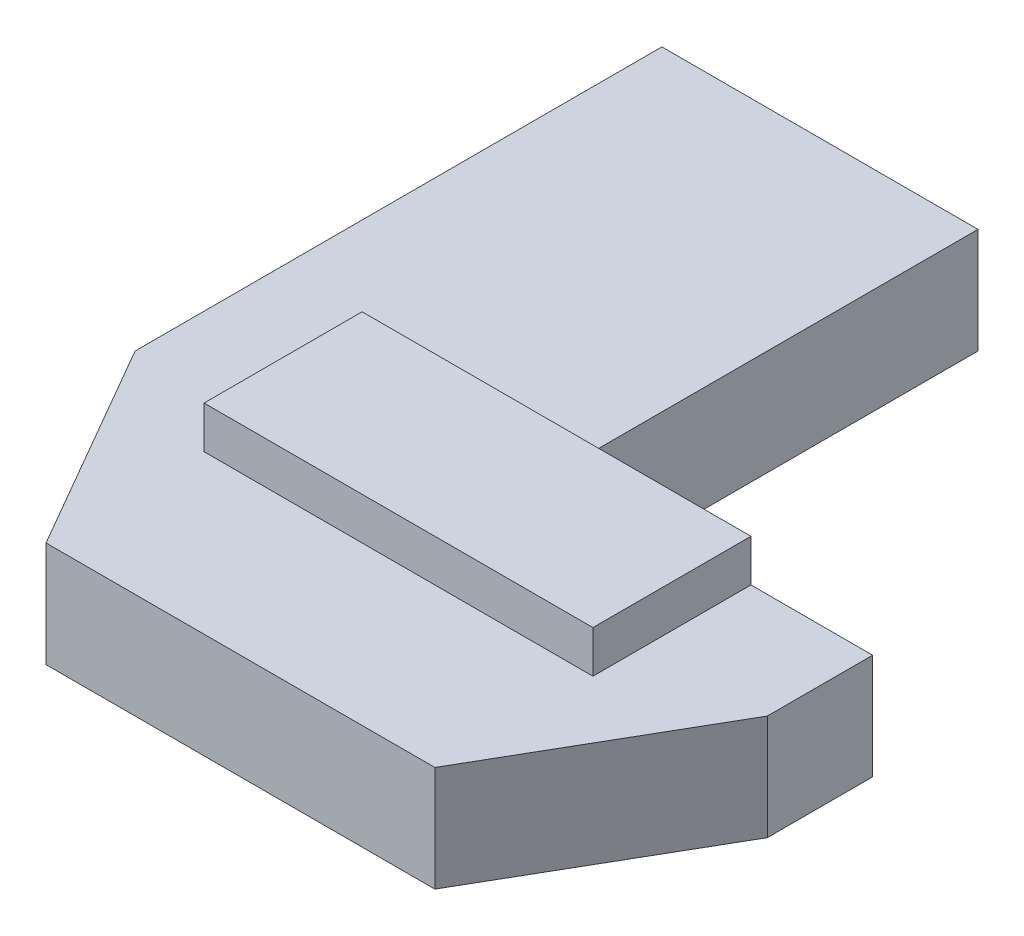
ISO-10303-21;
HEADER;
FILE_DESCRIPTION(('STEP AP214'),'2;1');
FILE_NAME('part.step','',(''),(''),'','','');
FILE_SCHEMA(('AUTOMOTIVE_DESIGN { 1 0 10303 214 1 1 1 1 }'));
ENDSEC;
DATA;
#1=APPLICATION_CONTEXT('core data for automotive mechanical design processes');
#2=APPLICATION_PROTOCOL_DEFINITION('international standard','automotive_design',2000,#1);
#3=PRODUCT_CONTEXT('',#1,'mechanical');
#4=PRODUCT('Part','Part','',(#3));
#5=PRODUCT_RELATED_PRODUCT_CATEGORY('part','',(#4));
#6=PRODUCT_DEFINITION_FORMATION('','',#4);
#7=PRODUCT_DEFINITION_CONTEXT('part definition',#1,'design');
#8=PRODUCT_DEFINITION('design','',#6,#7);
#9=PRODUCT_DEFINITION_SHAPE('','',#8);
#10=(LENGTH_UNIT() NAMED_UNIT(*) SI_UNIT(.MILLI.,.METRE.));
#11=(NAMED_UNIT(*) PLANE_ANGLE_UNIT() SI_UNIT($,.RADIAN.));
#12=(NAMED_UNIT(*) SI_UNIT($,.STERADIAN.) SOLID_ANGLE_UNIT());
#13=UNCERTAINTY_MEASURE_WITH_UNIT(LENGTH_MEASURE(1.E-05),#10,'distance_accuracy_value','');
#14=(GEOMETRIC_REPRESENTATION_CONTEXT(3) GLOBAL_UNCERTAINTY_ASSIGNED_CONTEXT((#13)) GLOBAL_UNIT_ASSIGNED_CONTEXT((#10,
#11,#12)) REPRESENTATION_CONTEXT('',''));
#15=CARTESIAN_POINT('',(0.,0.,0.));
#16=DIRECTION('',(0.,0.,1.));
#17=DIRECTION('',(1.,0.,0.));
#18=AXIS2_PLACEMENT_3D('',#15,#16,#17);
#19=CARTESIAN_POINT('',(0.,5.,0.));
#20=DIRECTION('',(0.,-1.,0.));
#21=DIRECTION('',(0.,0.,-1.));
#22=AXIS2_PLACEMENT_3D('',#19,#20,#21);
#23=PLANE('',#22);
#24=DIRECTION('',(0.,0.,-1.));
#25=VECTOR('',#24,1.);
#26=CARTESIAN_POINT('',(9.22649730810377,5.,0.));
#27=LINE('',#26,#25);
#28=CARTESIAN_POINT('',(9.22649730810378,5.,7.5));
#29=VERTEX_POINT('',#28);
#30=CARTESIAN_POINT('',(9.22649730810377,5.,0.));
#31=VERTEX_POINT('',#30);
#32=EDGE_CURVE('E37',#29,#31,#27,.T.);
#33=ORIENTED_EDGE('',*,*,#32,.F.);
#34=DIRECTION('',(1.,0.,0.));
#35=VECTOR('',#34,1.);
#36=CARTESIAN_POINT('',(9.22649730810378,5.,7.5));
#37=LINE('',#36,#35);
#38=CARTESIAN_POINT('',(-9.22649730810377,5.,7.5));
#39=VERTEX_POINT('',#38);
#40=EDGE_CURVE('E54',#39,#29,#37,.T.);
#41=ORIENTED_EDGE('',*,*,#40,.F.);
#42=DIRECTION('',(0.,0.,1.));
#43=VECTOR('',#42,1.);
#44=CARTESIAN_POINT('',(-9.22649730810377,5.,0.));
#45=LINE('',#44,#43);
#46=CARTESIAN_POINT('',(-9.22649730810377,5.,0.));
#47=VERTEX_POINT('',#46);
#48=EDGE_CURVE('E245',#47,#39,#45,.T.);
#49=ORIENTED_EDGE('',*,*,#48,.F.);
#50=DIRECTION('',(-1.,0.,0.));
#51=VECTOR('',#50,1.);
#52=CARTESIAN_POINT('',(9.22649730810377,5.,0.));
#53=LINE('',#52,#51);
#54=CARTESIAN_POINT('',(0.,5.,0.));
#55=VERTEX_POINT('',#54);
#56=EDGE_CURVE('E11',#55,#47,#53,.T.);
#57=ORIENTED_EDGE('',*,*,#56,.F.);
#58=DIRECTION('',(0.,0.,-1.));
#59=VECTOR('',#58,1.);
#60=CARTESIAN_POINT('',(0.,5.,0.));
#61=LINE('',#60,#59);
#62=CARTESIAN_POINT('',(0.,5.,-20.));
#63=VERTEX_POINT('',#62);
#64=EDGE_CURVE('E159',#55,#63,#61,.T.);
#65=ORIENTED_EDGE('',*,*,#64,.T.);
#66=DIRECTION('',(-1.,0.,0.));
#67=VECTOR('',#66,1.);
#68=CARTESIAN_POINT('',(0.,5.,-20.));
#69=LINE('',#68,#67);
#70=CARTESIAN_POINT('',(-15.,5.,-20.));
#71=VERTEX_POINT('',#70);
#72=EDGE_CURVE('E160',#63,#71,#69,.T.);
#73=ORIENTED_EDGE('',*,*,#72,.T.);
#74=DIRECTION('',(0.,0.,-1.));
#75=VECTOR('',#74,1.);
#76=CARTESIAN_POINT('',(-15.,5.,-20.));
#77=LINE('',#76,#75);
#78=CARTESIAN_POINT('',(-15.,5.,5.));
#79=VERTEX_POINT('',#78);
#80=EDGE_CURVE('E216',#79,#71,#77,.T.);
#81=ORIENTED_EDGE('',*,*,#80,.F.);
#82=DIRECTION('',(-0.499999999999998,0.,-0.86602540378444));
#83=VECTOR('',#82,1.);
#84=CARTESIAN_POINT('',(-15.,5.,5.));
#85=LINE('',#84,#83);
#86=CARTESIAN_POINT('',(-9.22649730810377,5.,15.));
#87=VERTEX_POINT('',#86);
#88=EDGE_CURVE('E213',#87,#79,#85,.T.);
#89=ORIENTED_EDGE('',*,*,#88,.F.);
#90=DIRECTION('',(-1.,0.,0.));
#91=VECTOR('',#90,1.);
#92=CARTESIAN_POINT('',(-9.22649730810377,5.,15.));
#93=LINE('',#92,#91);
#94=CARTESIAN_POINT('',(9.22649730810378,5.,15.));
#95=VERTEX_POINT('',#94);
#96=EDGE_CURVE('E210',#95,#87,#93,.T.);
#97=ORIENTED_EDGE('',*,*,#96,.F.);
#98=DIRECTION('',(-0.499999999999998,0.,0.86602540378444));
#99=VECTOR('',#98,1.);
#100=CARTESIAN_POINT('',(9.22649730810378,5.,15.));
#101=LINE('',#100,#99);
#102=CARTESIAN_POINT('',(15.,5.,5.));
#103=VERTEX_POINT('',#102);
#104=EDGE_CURVE('E202',#103,#95,#101,.T.);
#105=ORIENTED_EDGE('',*,*,#104,.F.);
#106=DIRECTION('',(0.,0.,1.));
#107=VECTOR('',#106,1.);
#108=CARTESIAN_POINT('',(15.,5.,5.));
#109=LINE('',#108,#107);
#110=CARTESIAN_POINT('',(15.,5.,0.));
#111=VERTEX_POINT('',#110);
#112=EDGE_CURVE('E199',#111,#103,#109,.T.);
#113=ORIENTED_EDGE('',*,*,#112,.F.);
#114=DIRECTION('',(-1.,0.,0.));
#115=VECTOR('',#114,1.);
#116=CARTESIAN_POINT('',(25.,5.,0.));
#117=LINE('',#116,#115);
#118=EDGE_CURVE('E161',#111,#31,#117,.T.);
#119=ORIENTED_EDGE('',*,*,#118,.T.);
#120=EDGE_LOOP('',(#33,#41,#49,#57,#65,#73,#81,#89,#97,#105,#113,#119));
#121=FACE_BOUND('',#120,.T.);
#122=ADVANCED_FACE('F33',(#121),#23,.F.);
#123=CARTESIAN_POINT('',(25.,5.,0.));
#124=DIRECTION('',(0.,0.,1.));
#125=DIRECTION('',(1.,0.,0.));
#126=AXIS2_PLACEMENT_3D('',#123,#124,#125);
#127=PLANE('',#126);
#128=ORIENTED_EDGE('',*,*,#118,.F.);
#129=DIRECTION('',(0.,1.,0.));
#130=VECTOR('',#129,1.);
#131=CARTESIAN_POINT('',(15.,-0.00100000000000013,0.));
#132=LINE('',#131,#130);
#133=CARTESIAN_POINT('',(15.,0.,0.));
#134=VERTEX_POINT('',#133);
#135=EDGE_CURVE('E172',#134,#111,#132,.T.);
#136=ORIENTED_EDGE('',*,*,#135,.F.);
#137=DIRECTION('',(-1.,0.,0.));
#138=VECTOR('',#137,1.);
#139=CARTESIAN_POINT('',(25.,0.,0.));
#140=LINE('',#139,#138);
#141=CARTESIAN_POINT('',(0.,0.,0.));
#142=VERTEX_POINT('',#141);
#143=EDGE_CURVE('E176',#134,#142,#140,.T.);
#144=ORIENTED_EDGE('',*,*,#143,.T.);
#145=DIRECTION('',(0.,-1.,0.));
#146=VECTOR('',#145,1.);
#147=CARTESIAN_POINT('',(0.,5.,0.));
#148=LINE('',#147,#146);
#149=EDGE_CURVE('E43',#55,#142,#148,.T.);
#150=ORIENTED_EDGE('',*,*,#149,.F.);
#151=ORIENTED_EDGE('',*,*,#56,.T.);
#152=DIRECTION('',(0.,-1.,0.));
#153=VECTOR('',#152,1.);
#154=CARTESIAN_POINT('',(-9.22649730810377,7.,0.));
#155=LINE('',#154,#153);
#156=CARTESIAN_POINT('',(-9.22649730810377,7.,0.));
#157=VERTEX_POINT('',#156);
#158=EDGE_CURVE('E128',#157,#47,#155,.T.);
#159=ORIENTED_EDGE('',*,*,#158,.F.);
#160=DIRECTION('',(-1.,0.,0.));
#161=VECTOR('',#160,1.);
#162=CARTESIAN_POINT('',(9.22649730810377,7.,0.));
#163=LINE('',#162,#161);
#164=CARTESIAN_POINT('',(9.22649730810377,7.,0.));
#165=VERTEX_POINT('',#164);
#166=EDGE_CURVE('E122',#165,#157,#163,.T.);
#167=ORIENTED_EDGE('',*,*,#166,.F.);
#168=DIRECTION('',(0.,-1.,0.));
#169=VECTOR('',#168,1.);
#170=CARTESIAN_POINT('',(9.22649730810377,7.,0.));
#171=LINE('',#170,#169);
#172=EDGE_CURVE('E126',#165,#31,#171,.T.);
#173=ORIENTED_EDGE('',*,*,#172,.T.);
#174=EDGE_LOOP('',(#128,#136,#144,#150,#151,#159,#167,#173));
#175=FACE_BOUND('',#174,.T.);
#176=ADVANCED_FACE('F35',(#175),#127,.F.);
#177=CARTESIAN_POINT('',(0.,5.,0.));
#178=DIRECTION('',(-1.,0.,0.));
#179=DIRECTION('',(0.,0.,1.));
#180=AXIS2_PLACEMENT_3D('',#177,#178,#179);
#181=PLANE('',#180);
#182=DIRECTION('',(0.,0.,-1.));
#183=VECTOR('',#182,1.);
#184=CARTESIAN_POINT('',(0.,0.,0.));
#185=LINE('',#184,#183);
#186=CARTESIAN_POINT('',(0.,0.,-20.));
#187=VERTEX_POINT('',#186);
#188=EDGE_CURVE('E178',#142,#187,#185,.T.);
#189=ORIENTED_EDGE('',*,*,#188,.T.);
#190=DIRECTION('',(0.,-1.,0.));
#191=VECTOR('',#190,1.);
#192=CARTESIAN_POINT('',(0.,5.,-20.));
#193=LINE('',#192,#191);
#194=EDGE_CURVE('E156',#63,#187,#193,.T.);
#195=ORIENTED_EDGE('',*,*,#194,.F.);
#196=ORIENTED_EDGE('',*,*,#64,.F.);
#197=ORIENTED_EDGE('',*,*,#149,.T.);
#198=EDGE_LOOP('',(#189,#195,#196,#197));
#199=FACE_BOUND('',#198,.T.);
#200=ADVANCED_FACE('F269',(#199),#181,.F.);
#201=CARTESIAN_POINT('',(0.,5.,-20.));
#202=DIRECTION('',(0.,0.,1.));
#203=DIRECTION('',(1.,0.,0.));
#204=AXIS2_PLACEMENT_3D('',#201,#202,#203);
#205=PLANE('',#204);
#206=DIRECTION('',(-1.,0.,0.));
#207=VECTOR('',#206,1.);
#208=CARTESIAN_POINT('',(0.,0.,-20.));
#209=LINE('',#208,#207);
#210=CARTESIAN_POINT('',(-15.,0.,-20.));
#211=VERTEX_POINT('',#210);
#212=EDGE_CURVE('E167',#187,#211,#209,.T.);
#213=ORIENTED_EDGE('',*,*,#212,.T.);
#214=DIRECTION('',(0.,1.,0.));
#215=VECTOR('',#214,1.);
#216=CARTESIAN_POINT('',(-15.,-0.00100000000000013,-20.));
#217=LINE('',#216,#215);
#218=EDGE_CURVE('E179',#211,#71,#217,.T.);
#219=ORIENTED_EDGE('',*,*,#218,.T.);
#220=ORIENTED_EDGE('',*,*,#72,.F.);
#221=ORIENTED_EDGE('',*,*,#194,.T.);
#222=EDGE_LOOP('',(#213,#219,#220,#221));
#223=FACE_BOUND('',#222,.T.);
#224=ADVANCED_FACE('F185',(#223),#205,.F.);
#225=CARTESIAN_POINT('',(0.,0.,0.));
#226=DIRECTION('',(0.,-1.,0.));
#227=DIRECTION('',(0.,0.,-1.));
#228=AXIS2_PLACEMENT_3D('',#225,#226,#227);
#229=PLANE('',#228);
#230=DIRECTION('',(0.,0.,-1.));
#231=VECTOR('',#230,1.);
#232=CARTESIAN_POINT('',(-15.,0.,-20.));
#233=LINE('',#232,#231);
#234=CARTESIAN_POINT('',(-15.,0.,5.));
#235=VERTEX_POINT('',#234);
#236=EDGE_CURVE('E194',#235,#211,#233,.T.);
#237=ORIENTED_EDGE('',*,*,#236,.T.);
#238=ORIENTED_EDGE('',*,*,#212,.F.);
#239=ORIENTED_EDGE('',*,*,#188,.F.);
#240=ORIENTED_EDGE('',*,*,#143,.F.);
#241=DIRECTION('',(0.,0.,1.));
#242=VECTOR('',#241,1.);
#243=CARTESIAN_POINT('',(15.,0.,5.));
#244=LINE('',#243,#242);
#245=CARTESIAN_POINT('',(15.,0.,5.));
#246=VERTEX_POINT('',#245);
#247=EDGE_CURVE('E143',#134,#246,#244,.T.);
#248=ORIENTED_EDGE('',*,*,#247,.T.);
#249=DIRECTION('',(-0.499999999999998,0.,0.86602540378444));
#250=VECTOR('',#249,1.);
#251=CARTESIAN_POINT('',(9.22649730810378,0.,15.));
#252=LINE('',#251,#250);
#253=CARTESIAN_POINT('',(9.22649730810378,0.,15.));
#254=VERTEX_POINT('',#253);
#255=EDGE_CURVE('E146',#246,#254,#252,.T.);
#256=ORIENTED_EDGE('',*,*,#255,.T.);
#257=DIRECTION('',(-1.,0.,0.));
#258=VECTOR('',#257,1.);
#259=CARTESIAN_POINT('',(-9.22649730810377,0.,15.));
#260=LINE('',#259,#258);
#261=CARTESIAN_POINT('',(-9.22649730810377,0.,15.));
#262=VERTEX_POINT('',#261);
#263=EDGE_CURVE('E204',#254,#262,#260,.T.);
#264=ORIENTED_EDGE('',*,*,#263,.T.);
#265=DIRECTION('',(-0.499999999999998,0.,-0.86602540378444));
#266=VECTOR('',#265,1.);
#267=CARTESIAN_POINT('',(-15.,0.,5.));
#268=LINE('',#267,#266);
#269=EDGE_CURVE('E196',#262,#235,#268,.T.);
#270=ORIENTED_EDGE('',*,*,#269,.T.);
#271=EDGE_LOOP('',(#237,#238,#239,#240,#248,#256,#264,#270));
#272=FACE_BOUND('',#271,.T.);
#273=ADVANCED_FACE('F191',(#272),#229,.T.);
#274=CARTESIAN_POINT('',(-15.,-0.00100000000000013,-20.));
#275=DIRECTION('',(1.,0.,0.));
#276=DIRECTION('',(0.,0.,-1.));
#277=AXIS2_PLACEMENT_3D('',#274,#275,#276);
#278=PLANE('',#277);
#279=DIRECTION('',(0.,1.,0.));
#280=VECTOR('',#279,1.);
#281=CARTESIAN_POINT('',(-15.,-0.00100000000000013,5.));
#282=LINE('',#281,#280);
#283=EDGE_CURVE('E219',#235,#79,#282,.T.);
#284=ORIENTED_EDGE('',*,*,#283,.T.);
#285=ORIENTED_EDGE('',*,*,#80,.T.);
#286=ORIENTED_EDGE('',*,*,#218,.F.);
#287=ORIENTED_EDGE('',*,*,#236,.F.);
#288=EDGE_LOOP('',(#284,#285,#286,#287));
#289=FACE_BOUND('',#288,.T.);
#290=ADVANCED_FACE('F275',(#289),#278,.F.);
#291=CARTESIAN_POINT('',(-15.,-0.00100000000000013,5.));
#292=DIRECTION('',(0.86602540378444,0.,-0.499999999999998));
#293=DIRECTION('',(-0.499999999999998,0.,-0.86602540378444));
#294=AXIS2_PLACEMENT_3D('',#291,#292,#293);
#295=PLANE('',#294);
#296=DIRECTION('',(0.,1.,0.));
#297=VECTOR('',#296,1.);
#298=CARTESIAN_POINT('',(-9.22649730810377,-0.00100000000000013,15.));
#299=LINE('',#298,#297);
#300=EDGE_CURVE('E221',#262,#87,#299,.T.);
#301=ORIENTED_EDGE('',*,*,#300,.T.);
#302=ORIENTED_EDGE('',*,*,#88,.T.);
#303=ORIENTED_EDGE('',*,*,#283,.F.);
#304=ORIENTED_EDGE('',*,*,#269,.F.);
#305=EDGE_LOOP('',(#301,#302,#303,#304));
#306=FACE_BOUND('',#305,.T.);
#307=ADVANCED_FACE('F286',(#306),#295,.F.);
#308=CARTESIAN_POINT('',(-9.22649730810377,-0.00100000000000013,15.));
#309=DIRECTION('',(0.,0.,-1.));
#310=DIRECTION('',(-1.,0.,0.));
#311=AXIS2_PLACEMENT_3D('',#308,#309,#310);
#312=PLANE('',#311);
#313=DIRECTION('',(0.,1.,0.));
#314=VECTOR('',#313,1.);
#315=CARTESIAN_POINT('',(9.22649730810378,-0.00100000000000013,15.));
#316=LINE('',#315,#314);
#317=EDGE_CURVE('E223',#254,#95,#316,.T.);
#318=ORIENTED_EDGE('',*,*,#317,.T.);
#319=ORIENTED_EDGE('',*,*,#96,.T.);
#320=ORIENTED_EDGE('',*,*,#300,.F.);
#321=ORIENTED_EDGE('',*,*,#263,.F.);
#322=EDGE_LOOP('',(#318,#319,#320,#321));
#323=FACE_BOUND('',#322,.T.);
#324=ADVANCED_FACE('F288',(#323),#312,.F.);
#325=CARTESIAN_POINT('',(9.22649730810378,-0.00100000000000013,15.));
#326=DIRECTION('',(-0.86602540378444,0.,-0.499999999999998));
#327=DIRECTION('',(-0.499999999999998,0.,0.86602540378444));
#328=AXIS2_PLACEMENT_3D('',#325,#326,#327);
#329=PLANE('',#328);
#330=DIRECTION('',(0.,1.,0.));
#331=VECTOR('',#330,1.);
#332=CARTESIAN_POINT('',(15.,-0.00100000000000013,5.));
#333=LINE('',#332,#331);
#334=EDGE_CURVE('E224',#246,#103,#333,.T.);
#335=ORIENTED_EDGE('',*,*,#334,.T.);
#336=ORIENTED_EDGE('',*,*,#104,.T.);
#337=ORIENTED_EDGE('',*,*,#317,.F.);
#338=ORIENTED_EDGE('',*,*,#255,.F.);
#339=EDGE_LOOP('',(#335,#336,#337,#338));
#340=FACE_BOUND('',#339,.T.);
#341=ADVANCED_FACE('F235',(#340),#329,.F.);
#342=CARTESIAN_POINT('',(15.,-0.00100000000000013,5.));
#343=DIRECTION('',(-1.,0.,0.));
#344=DIRECTION('',(0.,0.,1.));
#345=AXIS2_PLACEMENT_3D('',#342,#343,#344);
#346=PLANE('',#345);
#347=ORIENTED_EDGE('',*,*,#135,.T.);
#348=ORIENTED_EDGE('',*,*,#112,.T.);
#349=ORIENTED_EDGE('',*,*,#334,.F.);
#350=ORIENTED_EDGE('',*,*,#247,.F.);
#351=EDGE_LOOP('',(#347,#348,#349,#350));
#352=FACE_BOUND('',#351,.T.);
#353=ADVANCED_FACE('F230',(#352),#346,.F.);
#354=CARTESIAN_POINT('',(9.22649730810377,7.,0.));
#355=DIRECTION('',(-1.,0.,0.));
#356=DIRECTION('',(0.,0.,1.));
#357=AXIS2_PLACEMENT_3D('',#354,#355,#356);
#358=PLANE('',#357);
#359=ORIENTED_EDGE('',*,*,#32,.T.);
#360=ORIENTED_EDGE('',*,*,#172,.F.);
#361=DIRECTION('',(0.,0.,-1.));
#362=VECTOR('',#361,1.);
#363=CARTESIAN_POINT('',(9.22649730810377,7.,0.));
#364=LINE('',#363,#362);
#365=CARTESIAN_POINT('',(9.22649730810378,7.,7.5));
#366=VERTEX_POINT('',#365);
#367=EDGE_CURVE('E132',#366,#165,#364,.T.);
#368=ORIENTED_EDGE('',*,*,#367,.F.);
#369=DIRECTION('',(0.,-1.,0.));
#370=VECTOR('',#369,1.);
#371=CARTESIAN_POINT('',(9.22649730810378,7.,7.5));
#372=LINE('',#371,#370);
#373=EDGE_CURVE('E242',#366,#29,#372,.T.);
#374=ORIENTED_EDGE('',*,*,#373,.T.);
#375=EDGE_LOOP('',(#359,#360,#368,#374));
#376=FACE_BOUND('',#375,.T.);
#377=ADVANCED_FACE('F142',(#376),#358,.F.);
#378=CARTESIAN_POINT('',(-9.22649730810377,7.,0.));
#379=DIRECTION('',(1.,0.,0.));
#380=DIRECTION('',(0.,0.,-1.));
#381=AXIS2_PLACEMENT_3D('',#378,#379,#380);
#382=PLANE('',#381);
#383=ORIENTED_EDGE('',*,*,#48,.T.);
#384=DIRECTION('',(0.,-1.,0.));
#385=VECTOR('',#384,1.);
#386=CARTESIAN_POINT('',(-9.22649730810377,7.,7.5));
#387=LINE('',#386,#385);
#388=CARTESIAN_POINT('',(-9.22649730810377,7.,7.5));
#389=VERTEX_POINT('',#388);
#390=EDGE_CURVE('E148',#389,#39,#387,.T.);
#391=ORIENTED_EDGE('',*,*,#390,.F.);
#392=DIRECTION('',(0.,0.,1.));
#393=VECTOR('',#392,1.);
#394=CARTESIAN_POINT('',(-9.22649730810377,7.,0.));
#395=LINE('',#394,#393);
#396=EDGE_CURVE('E131',#157,#389,#395,.T.);
#397=ORIENTED_EDGE('',*,*,#396,.F.);
#398=ORIENTED_EDGE('',*,*,#158,.T.);
#399=EDGE_LOOP('',(#383,#391,#397,#398));
#400=FACE_BOUND('',#399,.T.);
#401=ADVANCED_FACE('F251',(#400),#382,.F.);
#402=CARTESIAN_POINT('',(9.22649730810378,7.,7.5));
#403=DIRECTION('',(0.,0.,-1.));
#404=DIRECTION('',(-1.,0.,0.));
#405=AXIS2_PLACEMENT_3D('',#402,#403,#404);
#406=PLANE('',#405);
#407=ORIENTED_EDGE('',*,*,#40,.T.);
#408=ORIENTED_EDGE('',*,*,#373,.F.);
#409=DIRECTION('',(1.,0.,0.));
#410=VECTOR('',#409,1.);
#411=CARTESIAN_POINT('',(9.22649730810378,7.,7.5));
#412=LINE('',#411,#410);
#413=EDGE_CURVE('E137',#389,#366,#412,.T.);
#414=ORIENTED_EDGE('',*,*,#413,.F.);
#415=ORIENTED_EDGE('',*,*,#390,.T.);
#416=EDGE_LOOP('',(#407,#408,#414,#415));
#417=FACE_BOUND('',#416,.T.);
#418=ADVANCED_FACE('F253',(#417),#406,.F.);
#419=CARTESIAN_POINT('',(0.,7.,0.));
#420=DIRECTION('',(0.,-1.,0.));
#421=DIRECTION('',(0.,0.,-1.));
#422=AXIS2_PLACEMENT_3D('',#419,#420,#421);
#423=PLANE('',#422);
#424=ORIENTED_EDGE('',*,*,#367,.T.);
#425=ORIENTED_EDGE('',*,*,#166,.T.);
#426=ORIENTED_EDGE('',*,*,#396,.T.);
#427=ORIENTED_EDGE('',*,*,#413,.T.);
#428=EDGE_LOOP('',(#424,#425,#426,#427));
#429=FACE_BOUND('',#428,.T.);
#430=ADVANCED_FACE('F135',(#429),#423,.F.);
#431=CLOSED_SHELL('',(#122,#176,#200,#224,#273,#290,#307,#324,#341,#353,#377,#401,#418,#430));
#432=MANIFOLD_SOLID_BREP('B2',#431);
#433=ADVANCED_BREP_SHAPE_REPRESENTATION('',(#18,#432),#14);
#434=SHAPE_DEFINITION_REPRESENTATION(#9,#433);
ENDSEC;
END-ISO-10303-21;
